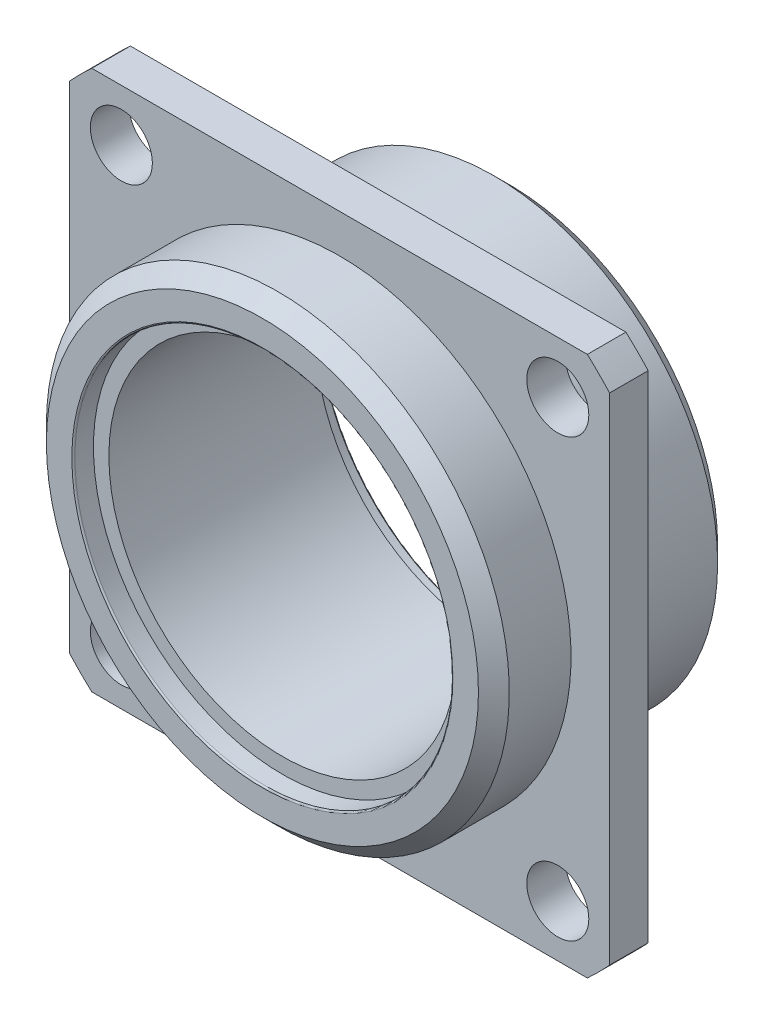
ISO-10303-21;
HEADER;
FILE_DESCRIPTION(('STEP AP214'),'2;1');
FILE_NAME('part.step','',(''),(''),'','','');
FILE_SCHEMA(('AUTOMOTIVE_DESIGN { 1 0 10303 214 1 1 1 1 }'));
ENDSEC;
DATA;
#1=APPLICATION_CONTEXT('core data for automotive mechanical design processes');
#2=APPLICATION_PROTOCOL_DEFINITION('international standard','automotive_design',2000,#1);
#3=PRODUCT_CONTEXT('',#1,'mechanical');
#4=PRODUCT('Part','Part','',(#3));
#5=PRODUCT_RELATED_PRODUCT_CATEGORY('part','',(#4));
#6=PRODUCT_DEFINITION_FORMATION('','',#4);
#7=PRODUCT_DEFINITION_CONTEXT('part definition',#1,'design');
#8=PRODUCT_DEFINITION('design','',#6,#7);
#9=PRODUCT_DEFINITION_SHAPE('','',#8);
#10=(LENGTH_UNIT() NAMED_UNIT(*) SI_UNIT(.MILLI.,.METRE.));
#11=(NAMED_UNIT(*) PLANE_ANGLE_UNIT() SI_UNIT($,.RADIAN.));
#12=(NAMED_UNIT(*) SI_UNIT($,.STERADIAN.) SOLID_ANGLE_UNIT());
#13=UNCERTAINTY_MEASURE_WITH_UNIT(LENGTH_MEASURE(1.E-05),#10,'distance_accuracy_value','');
#14=(GEOMETRIC_REPRESENTATION_CONTEXT(3) GLOBAL_UNCERTAINTY_ASSIGNED_CONTEXT((#13)) GLOBAL_UNIT_ASSIGNED_CONTEXT((#10,
#11,#12)) REPRESENTATION_CONTEXT('',''));
#15=CARTESIAN_POINT('',(0.,0.,0.));
#16=DIRECTION('',(0.,0.,1.));
#17=DIRECTION('',(1.,0.,0.));
#18=AXIS2_PLACEMENT_3D('',#15,#16,#17);
#19=CARTESIAN_POINT('',(0.,0.,4.699));
#20=DIRECTION('',(0.,0.,1.));
#21=DIRECTION('',(1.,0.,0.));
#22=AXIS2_PLACEMENT_3D('',#19,#20,#21);
#23=PLANE('',#22);
#24=CARTESIAN_POINT('',(0.,0.,4.699));
#25=DIRECTION('',(0.,0.,1.));
#26=DIRECTION('',(1.,0.,0.));
#27=AXIS2_PLACEMENT_3D('',#24,#25,#26);
#28=CIRCLE('',#27,14.2875);
#29=CARTESIAN_POINT('',(14.2875,0.,4.699));
#30=VERTEX_POINT('',#29);
#31=EDGE_CURVE('E244',#30,#30,#28,.F.);
#32=ORIENTED_EDGE('',*,*,#31,.T.);
#33=EDGE_LOOP('',(#32));
#34=FACE_BOUND('',#33,.T.);
#35=CARTESIAN_POINT('',(0.,0.,4.699));
#36=DIRECTION('',(0.,0.,1.));
#37=DIRECTION('',(1.,0.,0.));
#38=AXIS2_PLACEMENT_3D('',#35,#36,#37);
#39=CIRCLE('',#38,15.5575);
#40=CARTESIAN_POINT('',(15.5575,0.,4.699));
#41=VERTEX_POINT('',#40);
#42=EDGE_CURVE('E241',#41,#41,#39,.T.);
#43=ORIENTED_EDGE('',*,*,#42,.T.);
#44=EDGE_LOOP('',(#43));
#45=FACE_BOUND('',#44,.T.);
#46=ADVANCED_FACE('F17',(#34,#45),#23,.T.);
#47=CARTESIAN_POINT('',(0.,0.,-13.97));
#48=DIRECTION('',(0.,0.,1.));
#49=DIRECTION('',(1.,0.,0.));
#50=AXIS2_PLACEMENT_3D('',#47,#48,#49);
#51=CYLINDRICAL_SURFACE('',#50,14.2875);
#52=ORIENTED_EDGE('',*,*,#31,.F.);
#53=EDGE_LOOP('',(#52));
#54=FACE_BOUND('',#53,.T.);
#55=CARTESIAN_POINT('',(0.,0.,-12.319));
#56=DIRECTION('',(0.,0.,1.));
#57=DIRECTION('',(1.,0.,0.));
#58=AXIS2_PLACEMENT_3D('',#55,#56,#57);
#59=CIRCLE('',#58,14.2875);
#60=CARTESIAN_POINT('',(14.2875,0.,-12.319));
#61=VERTEX_POINT('',#60);
#62=EDGE_CURVE('E167',#61,#61,#59,.T.);
#63=ORIENTED_EDGE('',*,*,#62,.F.);
#64=EDGE_LOOP('',(#63));
#65=FACE_BOUND('',#64,.T.);
#66=ADVANCED_FACE('F475',(#54,#65),#51,.F.);
#67=CARTESIAN_POINT('',(0.,0.,4.699));
#68=DIRECTION('',(0.,0.,1.));
#69=DIRECTION('',(1.,0.,0.));
#70=AXIS2_PLACEMENT_3D('',#67,#68,#69);
#71=CYLINDRICAL_SURFACE('',#70,15.5575);
#72=ORIENTED_EDGE('',*,*,#42,.F.);
#73=EDGE_LOOP('',(#72));
#74=FACE_BOUND('',#73,.T.);
#75=CARTESIAN_POINT('',(0.,0.,6.223));
#76=DIRECTION('',(0.,0.,1.));
#77=DIRECTION('',(1.,0.,0.));
#78=AXIS2_PLACEMENT_3D('',#75,#76,#77);
#79=CIRCLE('',#78,15.5575);
#80=CARTESIAN_POINT('',(15.5575,0.,6.223));
#81=VERTEX_POINT('',#80);
#82=EDGE_CURVE('E160',#81,#81,#79,.F.);
#83=ORIENTED_EDGE('',*,*,#82,.F.);
#84=EDGE_LOOP('',(#83));
#85=FACE_BOUND('',#84,.T.);
#86=ADVANCED_FACE('F466',(#74,#85),#71,.F.);
#87=CARTESIAN_POINT('',(0.,0.,-12.319));
#88=DIRECTION('',(0.,0.,-1.));
#89=DIRECTION('',(-1.,0.,0.));
#90=AXIS2_PLACEMENT_3D('',#87,#88,#89);
#91=PLANE('',#90);
#92=ORIENTED_EDGE('',*,*,#62,.T.);
#93=EDGE_LOOP('',(#92));
#94=FACE_BOUND('',#93,.T.);
#95=CARTESIAN_POINT('',(0.,0.,-12.319));
#96=DIRECTION('',(0.,0.,-1.));
#97=DIRECTION('',(-1.,0.,0.));
#98=AXIS2_PLACEMENT_3D('',#95,#96,#97);
#99=CIRCLE('',#98,15.5575);
#100=CARTESIAN_POINT('',(-15.5575,0.,-12.319));
#101=VERTEX_POINT('',#100);
#102=EDGE_CURVE('E114',#101,#101,#99,.T.);
#103=ORIENTED_EDGE('',*,*,#102,.T.);
#104=EDGE_LOOP('',(#103));
#105=FACE_BOUND('',#104,.T.);
#106=ADVANCED_FACE('F153',(#94,#105),#91,.T.);
#107=CARTESIAN_POINT('',(0.,0.,6.223));
#108=DIRECTION('',(0.,0.,1.));
#109=DIRECTION('',(1.,0.,0.));
#110=AXIS2_PLACEMENT_3D('',#107,#108,#109);
#111=TOROIDAL_SURFACE('',#110,15.6845,0.127);
#112=ORIENTED_EDGE('',*,*,#82,.T.);
#113=EDGE_LOOP('',(#112));
#114=FACE_BOUND('',#113,.T.);
#115=CARTESIAN_POINT('',(0.,0.,6.35));
#116=DIRECTION('',(0.,0.,1.));
#117=DIRECTION('',(1.,0.,0.));
#118=AXIS2_PLACEMENT_3D('',#115,#116,#117);
#119=CIRCLE('',#118,15.6845);
#120=CARTESIAN_POINT('',(-15.6845,0.,6.35));
#121=VERTEX_POINT('',#120);
#122=CARTESIAN_POINT('',(15.6845,0.,6.35));
#123=VERTEX_POINT('',#122);
#124=EDGE_CURVE('E104',#121,#123,#119,.F.);
#125=ORIENTED_EDGE('',*,*,#124,.F.);
#126=CARTESIAN_POINT('',(0.,0.,6.35));
#127=DIRECTION('',(0.,0.,1.));
#128=DIRECTION('',(-1.,0.,0.));
#129=AXIS2_PLACEMENT_3D('',#126,#127,#128);
#130=CIRCLE('',#129,15.6845);
#131=EDGE_CURVE('E102',#123,#121,#130,.F.);
#132=ORIENTED_EDGE('',*,*,#131,.F.);
#133=EDGE_LOOP('',(#125,#132));
#134=FACE_BOUND('',#133,.T.);
#135=ADVANCED_FACE('F106',(#114,#134),#111,.T.);
#136=CARTESIAN_POINT('',(0.,0.,-12.319));
#137=DIRECTION('',(0.,0.,-1.));
#138=DIRECTION('',(-1.,0.,0.));
#139=AXIS2_PLACEMENT_3D('',#136,#137,#138);
#140=CYLINDRICAL_SURFACE('',#139,15.5575);
#141=ORIENTED_EDGE('',*,*,#102,.F.);
#142=EDGE_LOOP('',(#141));
#143=FACE_BOUND('',#142,.T.);
#144=CARTESIAN_POINT('',(0.,0.,-13.843));
#145=DIRECTION('',(0.,0.,-1.));
#146=DIRECTION('',(-1.,0.,0.));
#147=AXIS2_PLACEMENT_3D('',#144,#145,#146);
#148=CIRCLE('',#147,15.5575);
#149=CARTESIAN_POINT('',(-15.5575,0.,-13.843));
#150=VERTEX_POINT('',#149);
#151=EDGE_CURVE('E109',#150,#150,#148,.F.);
#152=ORIENTED_EDGE('',*,*,#151,.F.);
#153=EDGE_LOOP('',(#152));
#154=FACE_BOUND('',#153,.T.);
#155=ADVANCED_FACE('F133',(#143,#154),#140,.F.);
#156=CARTESIAN_POINT('',(0.,0.,6.35));
#157=DIRECTION('',(0.,0.,1.));
#158=DIRECTION('',(1.,0.,0.));
#159=AXIS2_PLACEMENT_3D('',#156,#157,#158);
#160=PLANE('',#159);
#161=CARTESIAN_POINT('',(0.,0.,6.35));
#162=DIRECTION('',(0.,0.,-1.));
#163=DIRECTION('',(-1.,0.,0.));
#164=AXIS2_PLACEMENT_3D('',#161,#162,#163);
#165=CIRCLE('',#164,17.78);
#166=CARTESIAN_POINT('',(-17.78,0.,6.35));
#167=VERTEX_POINT('',#166);
#168=EDGE_CURVE('E148',#167,#167,#165,.T.);
#169=ORIENTED_EDGE('',*,*,#168,.F.);
#170=EDGE_LOOP('',(#169));
#171=FACE_BOUND('',#170,.T.);
#172=ORIENTED_EDGE('',*,*,#131,.T.);
#173=ORIENTED_EDGE('',*,*,#124,.T.);
#174=EDGE_LOOP('',(#172,#173));
#175=FACE_BOUND('',#174,.T.);
#176=ADVANCED_FACE('F113',(#171,#175),#160,.T.);
#177=CARTESIAN_POINT('',(0.,0.,-13.843));
#178=DIRECTION('',(0.,0.,-1.));
#179=DIRECTION('',(-1.,0.,0.));
#180=AXIS2_PLACEMENT_3D('',#177,#178,#179);
#181=TOROIDAL_SURFACE('',#180,15.6845,0.127);
#182=ORIENTED_EDGE('',*,*,#151,.T.);
#183=EDGE_LOOP('',(#182));
#184=FACE_BOUND('',#183,.T.);
#185=CARTESIAN_POINT('',(0.,0.,-13.97));
#186=DIRECTION('',(0.,0.,-1.));
#187=DIRECTION('',(-1.,0.,0.));
#188=AXIS2_PLACEMENT_3D('',#185,#186,#187);
#189=CIRCLE('',#188,15.6845);
#190=CARTESIAN_POINT('',(15.6845,0.,-13.97));
#191=VERTEX_POINT('',#190);
#192=CARTESIAN_POINT('',(-15.6845,0.,-13.97));
#193=VERTEX_POINT('',#192);
#194=EDGE_CURVE('E93',#191,#193,#189,.F.);
#195=ORIENTED_EDGE('',*,*,#194,.F.);
#196=CARTESIAN_POINT('',(0.,0.,-13.97));
#197=DIRECTION('',(0.,0.,-1.));
#198=DIRECTION('',(1.,0.,0.));
#199=AXIS2_PLACEMENT_3D('',#196,#197,#198);
#200=CIRCLE('',#199,15.6845);
#201=EDGE_CURVE('E236',#193,#191,#200,.F.);
#202=ORIENTED_EDGE('',*,*,#201,.F.);
#203=EDGE_LOOP('',(#195,#202));
#204=FACE_BOUND('',#203,.T.);
#205=ADVANCED_FACE('F132',(#184,#204),#181,.T.);
#206=CARTESIAN_POINT('',(0.,0.,5.08000000000001));
#207=DIRECTION('',(0.,0.,-1.));
#208=DIRECTION('',(-1.,0.,0.));
#209=AXIS2_PLACEMENT_3D('',#206,#207,#208);
#210=CONICAL_SURFACE('',#209,19.05,0.785398163397449);
#211=ORIENTED_EDGE('',*,*,#168,.T.);
#212=EDGE_LOOP('',(#211));
#213=FACE_BOUND('',#212,.T.);
#214=CARTESIAN_POINT('',(0.,0.,5.08000000000001));
#215=DIRECTION('',(0.,0.,-1.));
#216=DIRECTION('',(-1.,0.,0.));
#217=AXIS2_PLACEMENT_3D('',#214,#215,#216);
#218=CIRCLE('',#217,19.05);
#219=CARTESIAN_POINT('',(-19.05,0.,5.08000000000001));
#220=VERTEX_POINT('',#219);
#221=EDGE_CURVE('E233',#220,#220,#218,.T.);
#222=ORIENTED_EDGE('',*,*,#221,.F.);
#223=EDGE_LOOP('',(#222));
#224=FACE_BOUND('',#223,.T.);
#225=ADVANCED_FACE('F276',(#213,#224),#210,.T.);
#226=CARTESIAN_POINT('',(0.,0.,-13.97));
#227=DIRECTION('',(0.,0.,-1.));
#228=DIRECTION('',(-1.,0.,0.));
#229=AXIS2_PLACEMENT_3D('',#226,#227,#228);
#230=PLANE('',#229);
#231=CARTESIAN_POINT('',(0.,0.,-13.97));
#232=DIRECTION('',(0.,0.,1.));
#233=DIRECTION('',(1.,0.,0.));
#234=AXIS2_PLACEMENT_3D('',#231,#232,#233);
#235=CIRCLE('',#234,17.145);
#236=CARTESIAN_POINT('',(17.145,0.,-13.97));
#237=VERTEX_POINT('',#236);
#238=EDGE_CURVE('E230',#237,#237,#235,.T.);
#239=ORIENTED_EDGE('',*,*,#238,.F.);
#240=EDGE_LOOP('',(#239));
#241=FACE_BOUND('',#240,.T.);
#242=ORIENTED_EDGE('',*,*,#201,.T.);
#243=ORIENTED_EDGE('',*,*,#194,.T.);
#244=EDGE_LOOP('',(#242,#243));
#245=FACE_BOUND('',#244,.T.);
#246=ADVANCED_FACE('F258',(#241,#245),#230,.T.);
#247=CARTESIAN_POINT('',(0.,0.,6.35));
#248=DIRECTION('',(0.,0.,-1.));
#249=DIRECTION('',(-1.,0.,0.));
#250=AXIS2_PLACEMENT_3D('',#247,#248,#249);
#251=CYLINDRICAL_SURFACE('',#250,19.05);
#252=ORIENTED_EDGE('',*,*,#221,.T.);
#253=EDGE_LOOP('',(#252));
#254=FACE_BOUND('',#253,.T.);
#255=CARTESIAN_POINT('',(0.,0.,0.));
#256=DIRECTION('',(0.,0.,-1.));
#257=DIRECTION('',(-1.,0.,0.));
#258=AXIS2_PLACEMENT_3D('',#255,#256,#257);
#259=CIRCLE('',#258,19.05);
#260=CARTESIAN_POINT('',(-19.05,0.,0.));
#261=VERTEX_POINT('',#260);
#262=EDGE_CURVE('E227',#261,#261,#259,.F.);
#263=ORIENTED_EDGE('',*,*,#262,.T.);
#264=EDGE_LOOP('',(#263));
#265=FACE_BOUND('',#264,.T.);
#266=ADVANCED_FACE('F275',(#254,#265),#251,.T.);
#267=CARTESIAN_POINT('',(0.,0.,-12.7));
#268=DIRECTION('',(0.,0.,1.));
#269=DIRECTION('',(1.,0.,0.));
#270=AXIS2_PLACEMENT_3D('',#267,#268,#269);
#271=CONICAL_SURFACE('',#270,18.415,0.785398163397443);
#272=CARTESIAN_POINT('',(0.,0.,-12.7));
#273=DIRECTION('',(0.,0.,1.));
#274=DIRECTION('',(1.,0.,0.));
#275=AXIS2_PLACEMENT_3D('',#272,#273,#274);
#276=CIRCLE('',#275,18.415);
#277=CARTESIAN_POINT('',(18.415,0.,-12.7));
#278=VERTEX_POINT('',#277);
#279=EDGE_CURVE('E217',#278,#278,#276,.T.);
#280=ORIENTED_EDGE('',*,*,#279,.F.);
#281=EDGE_LOOP('',(#280));
#282=FACE_BOUND('',#281,.T.);
#283=ORIENTED_EDGE('',*,*,#238,.T.);
#284=EDGE_LOOP('',(#283));
#285=FACE_BOUND('',#284,.T.);
#286=ADVANCED_FACE('F349',(#282,#285),#271,.T.);
#287=CARTESIAN_POINT('',(0.,0.,0.));
#288=DIRECTION('',(0.,0.,-1.));
#289=DIRECTION('',(-1.,0.,0.));
#290=AXIS2_PLACEMENT_3D('',#287,#288,#289);
#291=PLANE('',#290);
#292=CARTESIAN_POINT('',(-17.9605122421388,17.9605122421392,0.));
#293=DIRECTION('',(0.,0.,1.));
#294=DIRECTION('',(1.,0.,0.));
#295=AXIS2_PLACEMENT_3D('',#292,#293,#294);
#296=CIRCLE('',#295,2.5527);
#297=CARTESIAN_POINT('',(-15.4078122421388,17.9605122421392,0.));
#298=VERTEX_POINT('',#297);
#299=EDGE_CURVE('E214',#298,#298,#296,.F.);
#300=ORIENTED_EDGE('',*,*,#299,.T.);
#301=EDGE_LOOP('',(#300));
#302=FACE_BOUND('',#301,.T.);
#303=DIRECTION('',(0.,1.,0.));
#304=VECTOR('',#303,1.);
#305=CARTESIAN_POINT('',(-22.225,22.225,0.));
#306=LINE('',#305,#304);
#307=CARTESIAN_POINT('',(-22.225,20.3918067186309,0.));
#308=VERTEX_POINT('',#307);
#309=CARTESIAN_POINT('',(-22.225,-20.3918067186309,0.));
#310=VERTEX_POINT('',#309);
#311=EDGE_CURVE('E84',#308,#310,#306,.F.);
#312=ORIENTED_EDGE('',*,*,#311,.T.);
#313=CARTESIAN_POINT('',(0.,0.,0.));
#314=DIRECTION('',(0.,0.,1.));
#315=DIRECTION('',(1.,0.,0.));
#316=AXIS2_PLACEMENT_3D('',#313,#314,#315);
#317=CIRCLE('',#316,30.1625);
#318=CARTESIAN_POINT('',(-20.3918067186309,-22.225,0.));
#319=VERTEX_POINT('',#318);
#320=EDGE_CURVE('E196',#319,#310,#317,.F.);
#321=ORIENTED_EDGE('',*,*,#320,.F.);
#322=DIRECTION('',(1.,0.,0.));
#323=VECTOR('',#322,1.);
#324=CARTESIAN_POINT('',(22.225,-22.225,0.));
#325=LINE('',#324,#323);
#326=CARTESIAN_POINT('',(20.3918067186309,-22.225,0.));
#327=VERTEX_POINT('',#326);
#328=EDGE_CURVE('E202',#319,#327,#325,.T.);
#329=ORIENTED_EDGE('',*,*,#328,.T.);
#330=CARTESIAN_POINT('',(0.,0.,0.));
#331=DIRECTION('',(0.,0.,1.));
#332=DIRECTION('',(1.,0.,0.));
#333=AXIS2_PLACEMENT_3D('',#330,#331,#332);
#334=CIRCLE('',#333,30.1625);
#335=CARTESIAN_POINT('',(22.225,-20.3918067186309,0.));
#336=VERTEX_POINT('',#335);
#337=EDGE_CURVE('E199',#336,#327,#334,.F.);
#338=ORIENTED_EDGE('',*,*,#337,.F.);
#339=DIRECTION('',(0.,-1.,0.));
#340=VECTOR('',#339,1.);
#341=CARTESIAN_POINT('',(22.225,22.225,0.));
#342=LINE('',#341,#340);
#343=CARTESIAN_POINT('',(22.225,20.3918067186309,0.));
#344=VERTEX_POINT('',#343);
#345=EDGE_CURVE('E207',#336,#344,#342,.F.);
#346=ORIENTED_EDGE('',*,*,#345,.T.);
#347=CARTESIAN_POINT('',(0.,0.,0.));
#348=DIRECTION('',(0.,0.,1.));
#349=DIRECTION('',(1.,0.,0.));
#350=AXIS2_PLACEMENT_3D('',#347,#348,#349);
#351=CIRCLE('',#350,30.1625);
#352=CARTESIAN_POINT('',(20.3918067186309,22.225,0.));
#353=VERTEX_POINT('',#352);
#354=EDGE_CURVE('E204',#353,#344,#351,.F.);
#355=ORIENTED_EDGE('',*,*,#354,.F.);
#356=DIRECTION('',(1.,0.,0.));
#357=VECTOR('',#356,1.);
#358=CARTESIAN_POINT('',(22.225,22.225,0.));
#359=LINE('',#358,#357);
#360=CARTESIAN_POINT('',(-20.3918067186309,22.225,0.));
#361=VERTEX_POINT('',#360);
#362=EDGE_CURVE('E212',#353,#361,#359,.F.);
#363=ORIENTED_EDGE('',*,*,#362,.T.);
#364=CARTESIAN_POINT('',(0.,0.,0.));
#365=DIRECTION('',(0.,0.,1.));
#366=DIRECTION('',(1.,0.,0.));
#367=AXIS2_PLACEMENT_3D('',#364,#365,#366);
#368=CIRCLE('',#367,30.1625);
#369=EDGE_CURVE('E209',#308,#361,#368,.F.);
#370=ORIENTED_EDGE('',*,*,#369,.F.);
#371=EDGE_LOOP('',(#312,#321,#329,#338,#346,#355,#363,#370));
#372=FACE_BOUND('',#371,.T.);
#373=ORIENTED_EDGE('',*,*,#262,.F.);
#374=EDGE_LOOP('',(#373));
#375=FACE_BOUND('',#374,.T.);
#376=CARTESIAN_POINT('',(-17.9605122421392,-17.9605122421389,0.));
#377=DIRECTION('',(0.,0.,1.));
#378=DIRECTION('',(1.,0.,0.));
#379=AXIS2_PLACEMENT_3D('',#376,#377,#378);
#380=CIRCLE('',#379,2.5527);
#381=CARTESIAN_POINT('',(-15.4078122421392,-17.9605122421389,0.));
#382=VERTEX_POINT('',#381);
#383=EDGE_CURVE('E218',#382,#382,#380,.F.);
#384=ORIENTED_EDGE('',*,*,#383,.T.);
#385=EDGE_LOOP('',(#384));
#386=FACE_BOUND('',#385,.T.);
#387=CARTESIAN_POINT('',(17.960512242139,-17.9605122421391,0.));
#388=DIRECTION('',(0.,0.,1.));
#389=DIRECTION('',(1.,0.,0.));
#390=AXIS2_PLACEMENT_3D('',#387,#388,#389);
#391=CIRCLE('',#390,2.5527);
#392=CARTESIAN_POINT('',(20.513212242139,-17.9605122421391,0.));
#393=VERTEX_POINT('',#392);
#394=EDGE_CURVE('E221',#393,#393,#391,.F.);
#395=ORIENTED_EDGE('',*,*,#394,.T.);
#396=EDGE_LOOP('',(#395));
#397=FACE_BOUND('',#396,.T.);
#398=CARTESIAN_POINT('',(17.960512242139,17.960512242139,0.));
#399=DIRECTION('',(0.,0.,1.));
#400=DIRECTION('',(1.,0.,0.));
#401=AXIS2_PLACEMENT_3D('',#398,#399,#400);
#402=CIRCLE('',#401,2.5527);
#403=CARTESIAN_POINT('',(20.513212242139,17.960512242139,0.));
#404=VERTEX_POINT('',#403);
#405=EDGE_CURVE('E224',#404,#404,#402,.F.);
#406=ORIENTED_EDGE('',*,*,#405,.T.);
#407=EDGE_LOOP('',(#406));
#408=FACE_BOUND('',#407,.T.);
#409=ADVANCED_FACE('F346',(#302,#372,#375,#386,#397,#408),#291,.F.);
#410=CARTESIAN_POINT('',(17.960512242139,17.960512242139,0.));
#411=DIRECTION('',(0.,0.,1.));
#412=DIRECTION('',(1.,0.,0.));
#413=AXIS2_PLACEMENT_3D('',#410,#411,#412);
#414=CYLINDRICAL_SURFACE('',#413,2.5527);
#415=CARTESIAN_POINT('',(17.960512242139,17.960512242139,-3.175));
#416=DIRECTION('',(0.,0.,1.));
#417=DIRECTION('',(1.,0.,0.));
#418=AXIS2_PLACEMENT_3D('',#415,#416,#417);
#419=CIRCLE('',#418,2.5527);
#420=CARTESIAN_POINT('',(20.513212242139,17.960512242139,-3.175));
#421=VERTEX_POINT('',#420);
#422=EDGE_CURVE('E193',#421,#421,#419,.T.);
#423=ORIENTED_EDGE('',*,*,#422,.F.);
#424=EDGE_LOOP('',(#423));
#425=FACE_BOUND('',#424,.T.);
#426=ORIENTED_EDGE('',*,*,#405,.F.);
#427=EDGE_LOOP('',(#426));
#428=FACE_BOUND('',#427,.T.);
#429=ADVANCED_FACE('F342',(#425,#428),#414,.F.);
#430=CARTESIAN_POINT('',(17.960512242139,-17.9605122421391,0.));
#431=DIRECTION('',(0.,0.,1.));
#432=DIRECTION('',(1.,0.,0.));
#433=AXIS2_PLACEMENT_3D('',#430,#431,#432);
#434=CYLINDRICAL_SURFACE('',#433,2.5527);
#435=CARTESIAN_POINT('',(17.960512242139,-17.9605122421391,-3.175));
#436=DIRECTION('',(0.,0.,1.));
#437=DIRECTION('',(1.,0.,0.));
#438=AXIS2_PLACEMENT_3D('',#435,#436,#437);
#439=CIRCLE('',#438,2.5527);
#440=CARTESIAN_POINT('',(20.513212242139,-17.9605122421391,-3.175));
#441=VERTEX_POINT('',#440);
#442=EDGE_CURVE('E190',#441,#441,#439,.T.);
#443=ORIENTED_EDGE('',*,*,#442,.F.);
#444=EDGE_LOOP('',(#443));
#445=FACE_BOUND('',#444,.T.);
#446=ORIENTED_EDGE('',*,*,#394,.F.);
#447=EDGE_LOOP('',(#446));
#448=FACE_BOUND('',#447,.T.);
#449=ADVANCED_FACE('F338',(#445,#448),#434,.F.);
#450=CARTESIAN_POINT('',(-17.9605122421392,-17.9605122421389,0.));
#451=DIRECTION('',(0.,0.,1.));
#452=DIRECTION('',(1.,0.,0.));
#453=AXIS2_PLACEMENT_3D('',#450,#451,#452);
#454=CYLINDRICAL_SURFACE('',#453,2.5527);
#455=CARTESIAN_POINT('',(-17.9605122421392,-17.9605122421389,-3.175));
#456=DIRECTION('',(0.,0.,1.));
#457=DIRECTION('',(1.,0.,0.));
#458=AXIS2_PLACEMENT_3D('',#455,#456,#457);
#459=CIRCLE('',#458,2.5527);
#460=CARTESIAN_POINT('',(-15.4078122421392,-17.9605122421389,-3.175));
#461=VERTEX_POINT('',#460);
#462=EDGE_CURVE('E187',#461,#461,#459,.T.);
#463=ORIENTED_EDGE('',*,*,#462,.F.);
#464=EDGE_LOOP('',(#463));
#465=FACE_BOUND('',#464,.T.);
#466=ORIENTED_EDGE('',*,*,#383,.F.);
#467=EDGE_LOOP('',(#466));
#468=FACE_BOUND('',#467,.T.);
#469=ADVANCED_FACE('F334',(#465,#468),#454,.F.);
#470=CARTESIAN_POINT('',(-17.9605122421388,17.9605122421392,0.));
#471=DIRECTION('',(0.,0.,1.));
#472=DIRECTION('',(1.,0.,0.));
#473=AXIS2_PLACEMENT_3D('',#470,#471,#472);
#474=CYLINDRICAL_SURFACE('',#473,2.5527);
#475=CARTESIAN_POINT('',(-17.9605122421388,17.9605122421392,-3.175));
#476=DIRECTION('',(0.,0.,1.));
#477=DIRECTION('',(1.,0.,0.));
#478=AXIS2_PLACEMENT_3D('',#475,#476,#477);
#479=CIRCLE('',#478,2.5527);
#480=CARTESIAN_POINT('',(-15.4078122421388,17.9605122421392,-3.175));
#481=VERTEX_POINT('',#480);
#482=EDGE_CURVE('E184',#481,#481,#479,.T.);
#483=ORIENTED_EDGE('',*,*,#482,.F.);
#484=EDGE_LOOP('',(#483));
#485=FACE_BOUND('',#484,.T.);
#486=ORIENTED_EDGE('',*,*,#299,.F.);
#487=EDGE_LOOP('',(#486));
#488=FACE_BOUND('',#487,.T.);
#489=ADVANCED_FACE('F330',(#485,#488),#474,.F.);
#490=CARTESIAN_POINT('',(0.,0.,-13.97));
#491=DIRECTION('',(0.,0.,1.));
#492=DIRECTION('',(1.,0.,0.));
#493=AXIS2_PLACEMENT_3D('',#490,#491,#492);
#494=CYLINDRICAL_SURFACE('',#493,18.415);
#495=CARTESIAN_POINT('',(0.,0.,-3.175));
#496=DIRECTION('',(0.,0.,1.));
#497=DIRECTION('',(1.,0.,0.));
#498=AXIS2_PLACEMENT_3D('',#495,#496,#497);
#499=CIRCLE('',#498,18.415);
#500=CARTESIAN_POINT('',(18.415,0.,-3.175));
#501=VERTEX_POINT('',#500);
#502=EDGE_CURVE('E181',#501,#501,#499,.T.);
#503=ORIENTED_EDGE('',*,*,#502,.F.);
#504=EDGE_LOOP('',(#503));
#505=FACE_BOUND('',#504,.T.);
#506=ORIENTED_EDGE('',*,*,#279,.T.);
#507=EDGE_LOOP('',(#506));
#508=FACE_BOUND('',#507,.T.);
#509=ADVANCED_FACE('F327',(#505,#508),#494,.T.);
#510=CARTESIAN_POINT('',(-22.225,22.225,-3.175));
#511=DIRECTION('',(1.,0.,0.));
#512=DIRECTION('',(0.,1.,0.));
#513=AXIS2_PLACEMENT_3D('',#510,#511,#512);
#514=PLANE('',#513);
#515=DIRECTION('',(0.,1.,0.));
#516=VECTOR('',#515,1.);
#517=CARTESIAN_POINT('',(-22.225,0.,-3.175));
#518=LINE('',#517,#516);
#519=CARTESIAN_POINT('',(-22.225,-20.3918067186309,-3.175));
#520=VERTEX_POINT('',#519);
#521=CARTESIAN_POINT('',(-22.225,20.3918067186309,-3.175));
#522=VERTEX_POINT('',#521);
#523=EDGE_CURVE('E180',#520,#522,#518,.T.);
#524=ORIENTED_EDGE('',*,*,#523,.F.);
#525=DIRECTION('',(0.,0.,1.));
#526=VECTOR('',#525,1.);
#527=CARTESIAN_POINT('',(-22.225,-20.3918067186309,-13.97));
#528=LINE('',#527,#526);
#529=EDGE_CURVE('E380',#310,#520,#528,.F.);
#530=ORIENTED_EDGE('',*,*,#529,.F.);
#531=ORIENTED_EDGE('',*,*,#311,.F.);
#532=DIRECTION('',(0.,0.,1.));
#533=VECTOR('',#532,1.);
#534=CARTESIAN_POINT('',(-22.225,20.3918067186309,-13.97));
#535=LINE('',#534,#533);
#536=EDGE_CURVE('E213',#522,#308,#535,.T.);
#537=ORIENTED_EDGE('',*,*,#536,.F.);
#538=EDGE_LOOP('',(#524,#530,#531,#537));
#539=FACE_BOUND('',#538,.T.);
#540=ADVANCED_FACE('F323',(#539),#514,.F.);
#541=CARTESIAN_POINT('',(0.,0.,-13.97));
#542=DIRECTION('',(0.,0.,1.));
#543=DIRECTION('',(1.,0.,0.));
#544=AXIS2_PLACEMENT_3D('',#541,#542,#543);
#545=CYLINDRICAL_SURFACE('',#544,30.1625);
#546=DIRECTION('',(0.,0.,-1.));
#547=VECTOR('',#546,1.);
#548=CARTESIAN_POINT('',(-20.3918067186309,22.225,-3.175));
#549=LINE('',#548,#547);
#550=CARTESIAN_POINT('',(-20.3918067186309,22.225,-3.175));
#551=VERTEX_POINT('',#550);
#552=EDGE_CURVE('E366',#361,#551,#549,.T.);
#553=ORIENTED_EDGE('',*,*,#552,.T.);
#554=CARTESIAN_POINT('',(0.,0.,-3.175));
#555=DIRECTION('',(0.,0.,1.));
#556=DIRECTION('',(1.,0.,0.));
#557=AXIS2_PLACEMENT_3D('',#554,#555,#556);
#558=CIRCLE('',#557,30.1625);
#559=EDGE_CURVE('E177',#522,#551,#558,.F.);
#560=ORIENTED_EDGE('',*,*,#559,.F.);
#561=ORIENTED_EDGE('',*,*,#536,.T.);
#562=ORIENTED_EDGE('',*,*,#369,.T.);
#563=EDGE_LOOP('',(#553,#560,#561,#562));
#564=FACE_BOUND('',#563,.T.);
#565=ADVANCED_FACE('F319',(#564),#545,.T.);
#566=CARTESIAN_POINT('',(22.225,22.225,-3.175));
#567=DIRECTION('',(0.,-1.,0.));
#568=DIRECTION('',(0.,0.,-1.));
#569=AXIS2_PLACEMENT_3D('',#566,#567,#568);
#570=PLANE('',#569);
#571=DIRECTION('',(-1.,0.,0.));
#572=VECTOR('',#571,1.);
#573=CARTESIAN_POINT('',(0.,22.225,-3.175));
#574=LINE('',#573,#572);
#575=CARTESIAN_POINT('',(20.3918067186309,22.225,-3.175));
#576=VERTEX_POINT('',#575);
#577=EDGE_CURVE('E176',#551,#576,#574,.F.);
#578=ORIENTED_EDGE('',*,*,#577,.F.);
#579=ORIENTED_EDGE('',*,*,#552,.F.);
#580=ORIENTED_EDGE('',*,*,#362,.F.);
#581=DIRECTION('',(0.,0.,1.));
#582=VECTOR('',#581,1.);
#583=CARTESIAN_POINT('',(20.3918067186309,22.225,-13.97));
#584=LINE('',#583,#582);
#585=EDGE_CURVE('E208',#576,#353,#584,.T.);
#586=ORIENTED_EDGE('',*,*,#585,.F.);
#587=EDGE_LOOP('',(#578,#579,#580,#586));
#588=FACE_BOUND('',#587,.T.);
#589=ADVANCED_FACE('F315',(#588),#570,.F.);
#590=CARTESIAN_POINT('',(0.,0.,-13.97));
#591=DIRECTION('',(0.,0.,1.));
#592=DIRECTION('',(1.,0.,0.));
#593=AXIS2_PLACEMENT_3D('',#590,#591,#592);
#594=CYLINDRICAL_SURFACE('',#593,30.1625);
#595=DIRECTION('',(0.,0.,1.));
#596=VECTOR('',#595,1.);
#597=CARTESIAN_POINT('',(22.225,20.3918067186309,-3.175));
#598=LINE('',#597,#596);
#599=CARTESIAN_POINT('',(22.225,20.3918067186309,-3.175));
#600=VERTEX_POINT('',#599);
#601=EDGE_CURVE('E367',#344,#600,#598,.F.);
#602=ORIENTED_EDGE('',*,*,#601,.T.);
#603=CARTESIAN_POINT('',(0.,0.,-3.175));
#604=DIRECTION('',(0.,0.,1.));
#605=DIRECTION('',(1.,0.,0.));
#606=AXIS2_PLACEMENT_3D('',#603,#604,#605);
#607=CIRCLE('',#606,30.1625);
#608=EDGE_CURVE('E173',#576,#600,#607,.F.);
#609=ORIENTED_EDGE('',*,*,#608,.F.);
#610=ORIENTED_EDGE('',*,*,#585,.T.);
#611=ORIENTED_EDGE('',*,*,#354,.T.);
#612=EDGE_LOOP('',(#602,#609,#610,#611));
#613=FACE_BOUND('',#612,.T.);
#614=ADVANCED_FACE('F311',(#613),#594,.T.);
#615=CARTESIAN_POINT('',(22.225,22.225,-3.175));
#616=DIRECTION('',(-1.,0.,0.));
#617=DIRECTION('',(0.,-1.,0.));
#618=AXIS2_PLACEMENT_3D('',#615,#616,#617);
#619=PLANE('',#618);
#620=DIRECTION('',(0.,1.,0.));
#621=VECTOR('',#620,1.);
#622=CARTESIAN_POINT('',(22.225,0.,-3.175));
#623=LINE('',#622,#621);
#624=CARTESIAN_POINT('',(22.225,-20.3918067186309,-3.175));
#625=VERTEX_POINT('',#624);
#626=EDGE_CURVE('E172',#600,#625,#623,.F.);
#627=ORIENTED_EDGE('',*,*,#626,.F.);
#628=ORIENTED_EDGE('',*,*,#601,.F.);
#629=ORIENTED_EDGE('',*,*,#345,.F.);
#630=DIRECTION('',(0.,0.,1.));
#631=VECTOR('',#630,1.);
#632=CARTESIAN_POINT('',(22.225,-20.3918067186309,-13.97));
#633=LINE('',#632,#631);
#634=EDGE_CURVE('E203',#625,#336,#633,.T.);
#635=ORIENTED_EDGE('',*,*,#634,.F.);
#636=EDGE_LOOP('',(#627,#628,#629,#635));
#637=FACE_BOUND('',#636,.T.);
#638=ADVANCED_FACE('F307',(#637),#619,.F.);
#639=CARTESIAN_POINT('',(0.,0.,-13.97));
#640=DIRECTION('',(0.,0.,1.));
#641=DIRECTION('',(1.,0.,0.));
#642=AXIS2_PLACEMENT_3D('',#639,#640,#641);
#643=CYLINDRICAL_SURFACE('',#642,30.1625);
#644=DIRECTION('',(0.,0.,1.));
#645=VECTOR('',#644,1.);
#646=CARTESIAN_POINT('',(20.3918067186309,-22.225,-3.175));
#647=LINE('',#646,#645);
#648=CARTESIAN_POINT('',(20.3918067186309,-22.225,-3.175));
#649=VERTEX_POINT('',#648);
#650=EDGE_CURVE('E370',#327,#649,#647,.F.);
#651=ORIENTED_EDGE('',*,*,#650,.T.);
#652=CARTESIAN_POINT('',(0.,0.,-3.175));
#653=DIRECTION('',(0.,0.,1.));
#654=DIRECTION('',(1.,0.,0.));
#655=AXIS2_PLACEMENT_3D('',#652,#653,#654);
#656=CIRCLE('',#655,30.1625);
#657=EDGE_CURVE('E169',#625,#649,#656,.F.);
#658=ORIENTED_EDGE('',*,*,#657,.F.);
#659=ORIENTED_EDGE('',*,*,#634,.T.);
#660=ORIENTED_EDGE('',*,*,#337,.T.);
#661=EDGE_LOOP('',(#651,#658,#659,#660));
#662=FACE_BOUND('',#661,.T.);
#663=ADVANCED_FACE('F304',(#662),#643,.T.);
#664=CARTESIAN_POINT('',(22.225,-22.225,-3.175));
#665=DIRECTION('',(0.,1.,0.));
#666=DIRECTION('',(0.,0.,1.));
#667=AXIS2_PLACEMENT_3D('',#664,#665,#666);
#668=PLANE('',#667);
#669=DIRECTION('',(-1.,0.,0.));
#670=VECTOR('',#669,1.);
#671=CARTESIAN_POINT('',(0.,-22.225,-3.175));
#672=LINE('',#671,#670);
#673=CARTESIAN_POINT('',(-20.3918067186309,-22.225,-3.175));
#674=VERTEX_POINT('',#673);
#675=EDGE_CURVE('E28',#649,#674,#672,.T.);
#676=ORIENTED_EDGE('',*,*,#675,.F.);
#677=ORIENTED_EDGE('',*,*,#650,.F.);
#678=ORIENTED_EDGE('',*,*,#328,.F.);
#679=DIRECTION('',(0.,0.,1.));
#680=VECTOR('',#679,1.);
#681=CARTESIAN_POINT('',(-20.3918067186309,-22.225,-13.97));
#682=LINE('',#681,#680);
#683=EDGE_CURVE('E37',#674,#319,#682,.T.);
#684=ORIENTED_EDGE('',*,*,#683,.F.);
#685=EDGE_LOOP('',(#676,#677,#678,#684));
#686=FACE_BOUND('',#685,.T.);
#687=ADVANCED_FACE('F296',(#686),#668,.F.);
#688=CARTESIAN_POINT('',(0.,0.,-13.97));
#689=DIRECTION('',(0.,0.,1.));
#690=DIRECTION('',(1.,0.,0.));
#691=AXIS2_PLACEMENT_3D('',#688,#689,#690);
#692=CYLINDRICAL_SURFACE('',#691,30.1625);
#693=ORIENTED_EDGE('',*,*,#683,.T.);
#694=ORIENTED_EDGE('',*,*,#320,.T.);
#695=ORIENTED_EDGE('',*,*,#529,.T.);
#696=CARTESIAN_POINT('',(0.,0.,-3.175));
#697=DIRECTION('',(0.,0.,1.));
#698=DIRECTION('',(1.,0.,0.));
#699=AXIS2_PLACEMENT_3D('',#696,#697,#698);
#700=CIRCLE('',#699,30.1625);
#701=EDGE_CURVE('E11',#674,#520,#700,.F.);
#702=ORIENTED_EDGE('',*,*,#701,.F.);
#703=EDGE_LOOP('',(#693,#694,#695,#702));
#704=FACE_BOUND('',#703,.T.);
#705=ADVANCED_FACE('F290',(#704),#692,.T.);
#706=CARTESIAN_POINT('',(0.,0.,-3.175));
#707=DIRECTION('',(0.,0.,-1.));
#708=DIRECTION('',(-1.,0.,0.));
#709=AXIS2_PLACEMENT_3D('',#706,#707,#708);
#710=PLANE('',#709);
#711=ORIENTED_EDGE('',*,*,#675,.T.);
#712=ORIENTED_EDGE('',*,*,#701,.T.);
#713=ORIENTED_EDGE('',*,*,#523,.T.);
#714=ORIENTED_EDGE('',*,*,#559,.T.);
#715=ORIENTED_EDGE('',*,*,#577,.T.);
#716=ORIENTED_EDGE('',*,*,#608,.T.);
#717=ORIENTED_EDGE('',*,*,#626,.T.);
#718=ORIENTED_EDGE('',*,*,#657,.T.);
#719=EDGE_LOOP('',(#711,#712,#713,#714,#715,#716,#717,#718));
#720=FACE_BOUND('',#719,.T.);
#721=ORIENTED_EDGE('',*,*,#502,.T.);
#722=EDGE_LOOP('',(#721));
#723=FACE_BOUND('',#722,.T.);
#724=ORIENTED_EDGE('',*,*,#482,.T.);
#725=EDGE_LOOP('',(#724));
#726=FACE_BOUND('',#725,.T.);
#727=ORIENTED_EDGE('',*,*,#462,.T.);
#728=EDGE_LOOP('',(#727));
#729=FACE_BOUND('',#728,.T.);
#730=ORIENTED_EDGE('',*,*,#442,.T.);
#731=EDGE_LOOP('',(#730));
#732=FACE_BOUND('',#731,.T.);
#733=ORIENTED_EDGE('',*,*,#422,.T.);
#734=EDGE_LOOP('',(#733));
#735=FACE_BOUND('',#734,.T.);
#736=ADVANCED_FACE('F288',(#720,#723,#726,#729,#732,#735),#710,.T.);
#737=CLOSED_SHELL('',(#46,#66,#86,#106,#135,#155,#176,#205,#225,#246,#266,#286,#409,#429,#449,
#469,#489,#509,#540,#565,#589,#614,#638,#663,#687,#705,#736));
#738=MANIFOLD_SOLID_BREP('B1',#737);
#739=ADVANCED_BREP_SHAPE_REPRESENTATION('',(#18,#738),#14);
#740=SHAPE_DEFINITION_REPRESENTATION(#9,#739);
ENDSEC;
END-ISO-10303-21;
